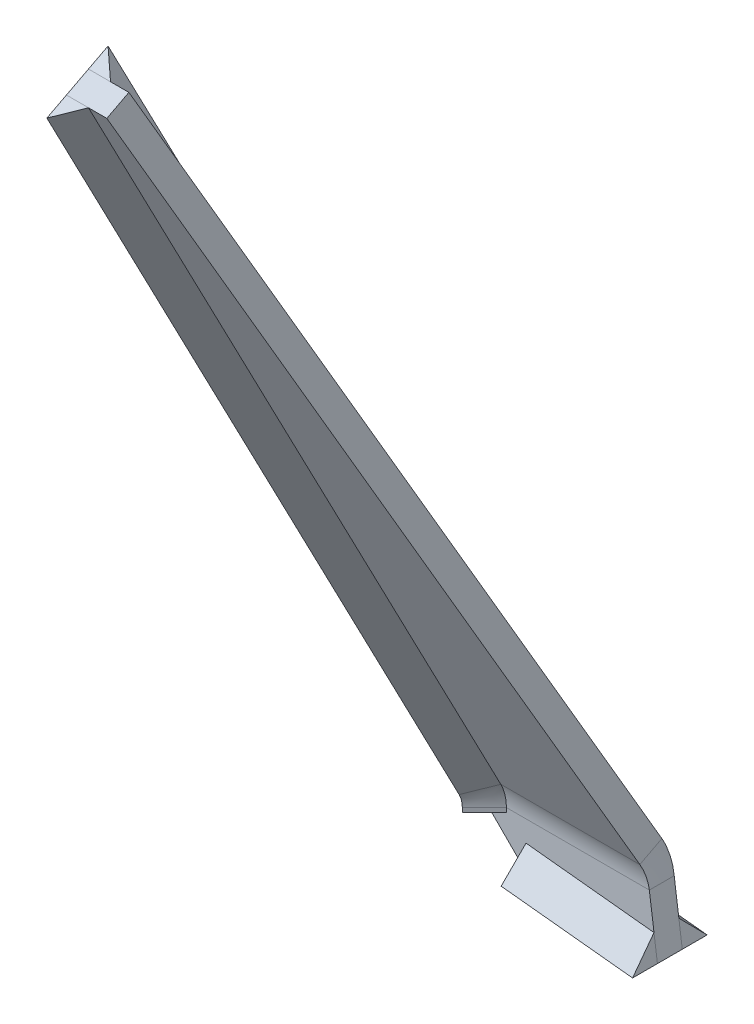
ISO-10303-21;
HEADER;
FILE_DESCRIPTION(('STEP AP214'),'2;1');
FILE_NAME('part.step','',(''),(''),'','','');
FILE_SCHEMA(('AUTOMOTIVE_DESIGN { 1 0 10303 214 1 1 1 1 }'));
ENDSEC;
DATA;
#1=APPLICATION_CONTEXT('core data for automotive mechanical design processes');
#2=APPLICATION_PROTOCOL_DEFINITION('international standard','automotive_design',2000,#1);
#3=PRODUCT_CONTEXT('',#1,'mechanical');
#4=PRODUCT('Part','Part','',(#3));
#5=PRODUCT_RELATED_PRODUCT_CATEGORY('part','',(#4));
#6=PRODUCT_DEFINITION_FORMATION('','',#4);
#7=PRODUCT_DEFINITION_CONTEXT('part definition',#1,'design');
#8=PRODUCT_DEFINITION('design','',#6,#7);
#9=PRODUCT_DEFINITION_SHAPE('','',#8);
#10=(LENGTH_UNIT() NAMED_UNIT(*) SI_UNIT(.MILLI.,.METRE.));
#11=(NAMED_UNIT(*) PLANE_ANGLE_UNIT() SI_UNIT($,.RADIAN.));
#12=(NAMED_UNIT(*) SI_UNIT($,.STERADIAN.) SOLID_ANGLE_UNIT());
#13=UNCERTAINTY_MEASURE_WITH_UNIT(LENGTH_MEASURE(1.E-05),#10,'distance_accuracy_value','');
#14=(GEOMETRIC_REPRESENTATION_CONTEXT(3) GLOBAL_UNCERTAINTY_ASSIGNED_CONTEXT((#13)) GLOBAL_UNIT_ASSIGNED_CONTEXT((#10,
#11,#12)) REPRESENTATION_CONTEXT('',''));
#15=CARTESIAN_POINT('',(0.,0.,0.));
#16=DIRECTION('',(0.,0.,1.));
#17=DIRECTION('',(1.,0.,0.));
#18=AXIS2_PLACEMENT_3D('',#15,#16,#17);
#19=CARTESIAN_POINT('',(3.54804333271289,6.67696676559559,3.99999999585428));
#20=DIRECTION('',(0.,6.51403475213452E-09,1.));
#21=DIRECTION('',(0.,-1.,6.51403475213452E-09));
#22=AXIS2_PLACEMENT_3D('',#19,#20,#21);
#23=PLANE('',#22);
#24=DIRECTION('',(-1.,0.,0.));
#25=VECTOR('',#24,1.);
#26=CARTESIAN_POINT('',(3.54804333271289,6.67696676559559,3.99999999585428));
#27=LINE('',#26,#25);
#28=CARTESIAN_POINT('',(3.54804333271289,6.67696676559559,3.99999999585428));
#29=VERTEX_POINT('',#28);
#30=CARTESIAN_POINT('',(0.,6.67696676559559,3.99999999585428));
#31=VERTEX_POINT('',#30);
#32=EDGE_CURVE('E128',#29,#31,#27,.T.);
#33=ORIENTED_EDGE('',*,*,#32,.F.);
#34=DIRECTION('',(0.,-1.,6.51403475213452E-09));
#35=VECTOR('',#34,1.);
#36=CARTESIAN_POINT('',(3.54804333271289,6.67696676559559,3.99999999585428));
#37=LINE('',#36,#35);
#38=CARTESIAN_POINT('',(3.54804333271289,6.00000000000006,4.00000000026407));
#39=VERTEX_POINT('',#38);
#40=EDGE_CURVE('E71',#29,#39,#37,.T.);
#41=ORIENTED_EDGE('',*,*,#40,.T.);
#42=DIRECTION('',(-1.,0.,0.));
#43=VECTOR('',#42,1.);
#44=CARTESIAN_POINT('',(3.54804333271289,6.00000000000006,4.00000000026407));
#45=LINE('',#44,#43);
#46=CARTESIAN_POINT('',(0.,6.00000000000006,4.00000000026407));
#47=VERTEX_POINT('',#46);
#48=EDGE_CURVE('E78',#39,#47,#45,.T.);
#49=ORIENTED_EDGE('',*,*,#48,.T.);
#50=DIRECTION('',(0.,-1.,6.51403475213452E-09));
#51=VECTOR('',#50,1.);
#52=CARTESIAN_POINT('',(0.,6.67696676559559,3.99999999585428));
#53=LINE('',#52,#51);
#54=EDGE_CURVE('E13',#31,#47,#53,.T.);
#55=ORIENTED_EDGE('',*,*,#54,.F.);
#56=EDGE_LOOP('',(#33,#41,#49,#55));
#57=FACE_BOUND('',#56,.T.);
#58=ADVANCED_FACE('F64',(#57),#23,.F.);
#59=CARTESIAN_POINT('',(0.,6.67696676463847,7.54804332856717));
#60=DIRECTION('',(-0.707106781186548,-4.60611813374007E-09,-0.707106781186547));
#61=DIRECTION('',(-0.707106781186547,0.,0.707106781186548));
#62=AXIS2_PLACEMENT_3D('',#59,#60,#61);
#63=PLANE('',#62);
#64=DIRECTION('',(0.707106781186547,1.90749860351502E-10,-0.707106781186548));
#65=VECTOR('',#64,1.);
#66=CARTESIAN_POINT('',(0.,6.67696676463847,7.54804332856717));
#67=LINE('',#66,#65);
#68=CARTESIAN_POINT('',(0.,6.67696676463847,7.54804332856717));
#69=VERTEX_POINT('',#68);
#70=EDGE_CURVE('E151',#69,#29,#67,.T.);
#71=ORIENTED_EDGE('',*,*,#70,.F.);
#72=DIRECTION('',(0.,-1.,6.51403475213452E-09));
#73=VECTOR('',#72,1.);
#74=CARTESIAN_POINT('',(0.,6.67696676463847,7.54804332856717));
#75=LINE('',#74,#73);
#76=CARTESIAN_POINT('',(0.,5.99999999904293,7.54804333297696));
#77=VERTEX_POINT('',#76);
#78=EDGE_CURVE('E123',#69,#77,#75,.T.);
#79=ORIENTED_EDGE('',*,*,#78,.T.);
#80=DIRECTION('',(0.707106781186547,1.90749860351502E-10,-0.707106781186548));
#81=VECTOR('',#80,1.);
#82=CARTESIAN_POINT('',(0.,5.99999999904293,7.54804333297696));
#83=LINE('',#82,#81);
#84=EDGE_CURVE('E86',#77,#39,#83,.T.);
#85=ORIENTED_EDGE('',*,*,#84,.T.);
#86=ORIENTED_EDGE('',*,*,#40,.F.);
#87=EDGE_LOOP('',(#71,#79,#85,#86));
#88=FACE_BOUND('',#87,.T.);
#89=ADVANCED_FACE('F164',(#88),#63,.F.);
#90=CARTESIAN_POINT('',(0.,6.67696676559554,12.0000000046738));
#91=DIRECTION('',(-1.,0.,0.));
#92=DIRECTION('',(0.,-1.,0.));
#93=AXIS2_PLACEMENT_3D('',#90,#91,#92);
#94=CYLINDRICAL_SURFACE('',#93,8.00000000881955);
#95=DIRECTION('',(-1.,0.,0.));
#96=VECTOR('',#95,1.);
#97=CARTESIAN_POINT('',(3.54804333271289,10.370955673634,4.90391333042855));
#98=LINE('',#97,#96);
#99=CARTESIAN_POINT('',(3.54804333271289,10.370955673634,4.90391333042855));
#100=VERTEX_POINT('',#99);
#101=CARTESIAN_POINT('',(0.,10.370955673634,4.90391333042855));
#102=VERTEX_POINT('',#101);
#103=EDGE_CURVE('E136',#100,#102,#98,.T.);
#104=ORIENTED_EDGE('',*,*,#103,.F.);
#105=CARTESIAN_POINT('',(3.54804333271289,6.67696676559554,12.0000000046738));
#106=DIRECTION('',(-1.,0.,0.));
#107=DIRECTION('',(0.,-1.,0.));
#108=AXIS2_PLACEMENT_3D('',#105,#106,#107);
#109=CIRCLE('',#108,8.00000000881955);
#110=EDGE_CURVE('E127',#100,#29,#109,.T.);
#111=ORIENTED_EDGE('',*,*,#110,.T.);
#112=ORIENTED_EDGE('',*,*,#32,.T.);
#113=CARTESIAN_POINT('',(0.,6.67696676559554,12.0000000046738));
#114=DIRECTION('',(-1.,0.,0.));
#115=DIRECTION('',(0.,-1.,0.));
#116=AXIS2_PLACEMENT_3D('',#113,#114,#115);
#117=CIRCLE('',#116,8.00000000881955);
#118=EDGE_CURVE('E156',#102,#31,#117,.T.);
#119=ORIENTED_EDGE('',*,*,#118,.F.);
#120=EDGE_LOOP('',(#104,#111,#112,#119));
#121=FACE_BOUND('',#120,.T.);
#122=ADVANCED_FACE('F166',(#121),#94,.T.);
#123=CARTESIAN_POINT('',(0.,6.67696676559554,12.0000000046738));
#124=DIRECTION('',(1.,0.,0.));
#125=DIRECTION('',(0.,1.,0.));
#126=AXIS2_PLACEMENT_3D('',#123,#124,#125);
#127=CONICAL_SURFACE('',#126,4.45195667610666,0.785398163397449);
#128=DIRECTION('',(0.707106781186547,0.326505575621977,-0.62721137512625));
#129=VECTOR('',#128,1.);
#130=CARTESIAN_POINT('',(0.,8.73265158505604,8.05106620313065));
#131=LINE('',#130,#129);
#132=CARTESIAN_POINT('',(0.,8.73265158505604,8.05106620313065));
#133=VERTEX_POINT('',#132);
#134=EDGE_CURVE('E131',#133,#100,#131,.T.);
#135=ORIENTED_EDGE('',*,*,#134,.F.);
#136=CARTESIAN_POINT('',(0.,6.67696676559554,12.0000000046738));
#137=DIRECTION('',(-1.,0.,0.));
#138=DIRECTION('',(0.,-1.,0.));
#139=AXIS2_PLACEMENT_3D('',#136,#137,#138);
#140=CIRCLE('',#139,4.45195667610666);
#141=EDGE_CURVE('E116',#133,#69,#140,.T.);
#142=ORIENTED_EDGE('',*,*,#141,.T.);
#143=ORIENTED_EDGE('',*,*,#70,.T.);
#144=ORIENTED_EDGE('',*,*,#110,.F.);
#145=EDGE_LOOP('',(#135,#142,#143,#144));
#146=FACE_BOUND('',#145,.T.);
#147=ADVANCED_FACE('F132',(#146),#127,.F.);
#148=CARTESIAN_POINT('',(0.,10.370955673634,4.90391333042855));
#149=DIRECTION('',(-1.,0.,0.));
#150=DIRECTION('',(0.,-1.,0.));
#151=AXIS2_PLACEMENT_3D('',#148,#149,#150);
#152=PLANE('',#151);
#153=DIRECTION('',(0.,-0.461748613235034,0.887010833178221));
#154=VECTOR('',#153,1.);
#155=CARTESIAN_POINT('',(0.,137.813981670746,71.2465534924042));
#156=LINE('',#155,#154);
#157=CARTESIAN_POINT('',(0.,137.813981670746,71.2465534924042));
#158=VERTEX_POINT('',#157);
#159=CARTESIAN_POINT('',(0.,136.175677582168,74.3937063651063));
#160=VERTEX_POINT('',#159);
#161=EDGE_CURVE('E175',#158,#160,#156,.T.);
#162=ORIENTED_EDGE('',*,*,#161,.F.);
#163=DIRECTION('',(0.,0.887010833163201,0.461748613263889));
#164=VECTOR('',#163,1.);
#165=CARTESIAN_POINT('',(0.,10.370955673634,4.90391333042855));
#166=LINE('',#165,#164);
#167=EDGE_CURVE('E145',#102,#158,#166,.T.);
#168=ORIENTED_EDGE('',*,*,#167,.F.);
#169=ORIENTED_EDGE('',*,*,#118,.T.);
#170=ORIENTED_EDGE('',*,*,#54,.T.);
#171=DIRECTION('',(0.,-2.69761157856152E-10,1.));
#172=VECTOR('',#171,1.);
#173=CARTESIAN_POINT('',(0.,6.00000000000006,4.00000000026407));
#174=LINE('',#173,#172);
#175=EDGE_CURVE('E159',#47,#77,#174,.T.);
#176=ORIENTED_EDGE('',*,*,#175,.T.);
#177=ORIENTED_EDGE('',*,*,#78,.F.);
#178=ORIENTED_EDGE('',*,*,#141,.F.);
#179=DIRECTION('',(0.,0.887010833163201,0.461748613263889));
#180=VECTOR('',#179,1.);
#181=CARTESIAN_POINT('',(0.,8.73265158505604,8.05106620313065));
#182=LINE('',#181,#180);
#183=EDGE_CURVE('E121',#133,#160,#182,.T.);
#184=ORIENTED_EDGE('',*,*,#183,.T.);
#185=EDGE_LOOP('',(#162,#168,#169,#170,#176,#177,#178,#184));
#186=FACE_BOUND('',#185,.T.);
#187=ADVANCED_FACE('F119',(#186),#152,.T.);
#188=CARTESIAN_POINT('',(3.54804333271289,10.370955673634,4.90391333042855));
#189=DIRECTION('',(0.,0.461748613263889,-0.887010833163201));
#190=DIRECTION('',(0.,0.887010833163201,0.461748613263889));
#191=AXIS2_PLACEMENT_3D('',#188,#189,#190);
#192=PLANE('',#191);
#193=DIRECTION('',(-1.,0.,0.));
#194=VECTOR('',#193,1.);
#195=CARTESIAN_POINT('',(3.54804333271288,137.813981670746,71.2465534924042));
#196=LINE('',#195,#194);
#197=CARTESIAN_POINT('',(3.54804333271288,137.813981670746,71.2465534924042));
#198=VERTEX_POINT('',#197);
#199=EDGE_CURVE('E137',#198,#158,#196,.T.);
#200=ORIENTED_EDGE('',*,*,#199,.F.);
#201=DIRECTION('',(0.,0.887010833163201,0.461748613263889));
#202=VECTOR('',#201,1.);
#203=CARTESIAN_POINT('',(3.54804333271289,10.370955673634,4.90391333042855));
#204=LINE('',#203,#202);
#205=EDGE_CURVE('E143',#100,#198,#204,.T.);
#206=ORIENTED_EDGE('',*,*,#205,.F.);
#207=ORIENTED_EDGE('',*,*,#103,.T.);
#208=ORIENTED_EDGE('',*,*,#167,.T.);
#209=EDGE_LOOP('',(#200,#206,#207,#208));
#210=FACE_BOUND('',#209,.T.);
#211=ADVANCED_FACE('F171',(#210),#192,.T.);
#212=CARTESIAN_POINT('',(0.,8.73265158505604,8.05106620313065));
#213=DIRECTION('',(0.707106781186548,-0.326505575642381,0.627211375115628));
#214=DIRECTION('',(0.663578618394135,0.,-0.748106554716727));
#215=AXIS2_PLACEMENT_3D('',#212,#213,#214);
#216=PLANE('',#215);
#217=DIRECTION('',(0.707106781186547,0.326505575621977,-0.62721137512625));
#218=VECTOR('',#217,1.);
#219=CARTESIAN_POINT('',(0.,136.175677582168,74.3937063651063));
#220=LINE('',#219,#218);
#221=EDGE_CURVE('E141',#160,#198,#220,.T.);
#222=ORIENTED_EDGE('',*,*,#221,.F.);
#223=ORIENTED_EDGE('',*,*,#183,.F.);
#224=ORIENTED_EDGE('',*,*,#134,.T.);
#225=ORIENTED_EDGE('',*,*,#205,.T.);
#226=EDGE_LOOP('',(#222,#223,#224,#225));
#227=FACE_BOUND('',#226,.T.);
#228=ADVANCED_FACE('F139',(#227),#216,.T.);
#229=CARTESIAN_POINT('',(0.,6.00000000000006,4.00000000026407));
#230=DIRECTION('',(0.,-1.,-2.69761157856152E-10));
#231=DIRECTION('',(0.,2.69761157856152E-10,-1.));
#232=AXIS2_PLACEMENT_3D('',#229,#230,#231);
#233=PLANE('',#232);
#234=ORIENTED_EDGE('',*,*,#175,.F.);
#235=ORIENTED_EDGE('',*,*,#48,.F.);
#236=ORIENTED_EDGE('',*,*,#84,.F.);
#237=EDGE_LOOP('',(#234,#235,#236));
#238=FACE_BOUND('',#237,.T.);
#239=ADVANCED_FACE('F180',(#238),#233,.T.);
#240=CARTESIAN_POINT('',(0.,137.813981670746,71.2465534924042));
#241=DIRECTION('',(0.,-0.887010833178221,-0.461748613235034));
#242=DIRECTION('',(0.,0.461748613235034,-0.887010833178221));
#243=AXIS2_PLACEMENT_3D('',#240,#241,#242);
#244=PLANE('',#243);
#245=ORIENTED_EDGE('',*,*,#161,.T.);
#246=ORIENTED_EDGE('',*,*,#221,.T.);
#247=ORIENTED_EDGE('',*,*,#199,.T.);
#248=EDGE_LOOP('',(#245,#246,#247));
#249=FACE_BOUND('',#248,.T.);
#250=ADVANCED_FACE('F174',(#249),#244,.F.);
#251=CLOSED_SHELL('',(#58,#89,#122,#147,#187,#211,#228,#239,#250));
#252=MANIFOLD_SOLID_BREP('B2',#251);
#253=CARTESIAN_POINT('',(3.54804333271289,6.67696676667466,-4.14576012408574E-09));
#254=DIRECTION('',(0.,-6.51403475213451E-09,-1.));
#255=DIRECTION('',(0.,1.,-6.51403475213451E-09));
#256=AXIS2_PLACEMENT_3D('',#253,#254,#255);
#257=PLANE('',#256);
#258=DIRECTION('',(1.,0.,0.));
#259=VECTOR('',#258,1.);
#260=CARTESIAN_POINT('',(3.54804333271289,6.67696676667466,-4.14576012408574E-09));
#261=LINE('',#260,#259);
#262=CARTESIAN_POINT('',(0.,6.67696676667466,-4.14575838936226E-09));
#263=VERTEX_POINT('',#262);
#264=CARTESIAN_POINT('',(3.54804333271289,6.67696676667466,-4.14576012408574E-09));
#265=VERTEX_POINT('',#264);
#266=EDGE_CURVE('E334',#263,#265,#261,.T.);
#267=ORIENTED_EDGE('',*,*,#266,.F.);
#268=DIRECTION('',(0.,-1.,6.51403475213452E-09));
#269=VECTOR('',#268,1.);
#270=CARTESIAN_POINT('',(0.,6.67696676667466,-4.14575838936226E-09));
#271=LINE('',#270,#269);
#272=CARTESIAN_POINT('',(0.,6.00000000107912,2.64026647767146E-10));
#273=VERTEX_POINT('',#272);
#274=EDGE_CURVE('E277',#263,#273,#271,.T.);
#275=ORIENTED_EDGE('',*,*,#274,.T.);
#276=DIRECTION('',(1.,0.,0.));
#277=VECTOR('',#276,1.);
#278=CARTESIAN_POINT('',(3.54804333271289,6.00000000107912,2.6402491304367E-10));
#279=LINE('',#278,#277);
#280=CARTESIAN_POINT('',(3.54804333271289,6.00000000107912,2.6402491304367E-10));
#281=VERTEX_POINT('',#280);
#282=EDGE_CURVE('E284',#273,#281,#279,.T.);
#283=ORIENTED_EDGE('',*,*,#282,.T.);
#284=DIRECTION('',(0.,-1.,6.51403475213452E-09));
#285=VECTOR('',#284,1.);
#286=CARTESIAN_POINT('',(3.54804333271289,6.67696676667466,-4.14576012408574E-09));
#287=LINE('',#286,#285);
#288=EDGE_CURVE('E62',#265,#281,#287,.T.);
#289=ORIENTED_EDGE('',*,*,#288,.F.);
#290=EDGE_LOOP('',(#267,#275,#283,#289));
#291=FACE_BOUND('',#290,.T.);
#292=ADVANCED_FACE('F270',(#291),#257,.F.);
#293=CARTESIAN_POINT('',(0.,6.67696676763178,-3.54804333685865));
#294=DIRECTION('',(-0.707106781186548,4.60611815849822E-09,0.707106781186547));
#295=DIRECTION('',(0.707106781186547,0.,0.707106781186548));
#296=AXIS2_PLACEMENT_3D('',#293,#294,#295);
#297=PLANE('',#296);
#298=DIRECTION('',(-0.707106781186547,1.90749971373805E-10,-0.707106781186548));
#299=VECTOR('',#298,1.);
#300=CARTESIAN_POINT('',(0.,6.67696676763178,-3.54804333685865));
#301=LINE('',#300,#299);
#302=CARTESIAN_POINT('',(0.,6.67696676763178,-3.54804333685865));
#303=VERTEX_POINT('',#302);
#304=EDGE_CURVE('E332',#265,#303,#301,.T.);
#305=ORIENTED_EDGE('',*,*,#304,.F.);
#306=ORIENTED_EDGE('',*,*,#288,.T.);
#307=DIRECTION('',(-0.707106781186547,1.90749971373805E-10,-0.707106781186548));
#308=VECTOR('',#307,1.);
#309=CARTESIAN_POINT('',(0.,6.00000000203625,-3.54804333244886));
#310=LINE('',#309,#308);
#311=CARTESIAN_POINT('',(0.,6.00000000203625,-3.54804333244886));
#312=VERTEX_POINT('',#311);
#313=EDGE_CURVE('E368',#281,#312,#310,.T.);
#314=ORIENTED_EDGE('',*,*,#313,.T.);
#315=DIRECTION('',(0.,-1.,6.51403475213452E-09));
#316=VECTOR('',#315,1.);
#317=CARTESIAN_POINT('',(0.,6.67696676763178,-3.54804333685865));
#318=LINE('',#317,#316);
#319=EDGE_CURVE('E372',#303,#312,#318,.T.);
#320=ORIENTED_EDGE('',*,*,#319,.F.);
#321=EDGE_LOOP('',(#305,#306,#314,#320));
#322=FACE_BOUND('',#321,.T.);
#323=ADVANCED_FACE('F393',(#322),#297,.F.);
#324=CARTESIAN_POINT('',(0.,6.67696676559554,12.0000000046738));
#325=DIRECTION('',(-1.,0.,0.));
#326=DIRECTION('',(0.,-1.,0.));
#327=AXIS2_PLACEMENT_3D('',#324,#325,#326);
#328=CYLINDRICAL_SURFACE('',#327,12.0000000088196);
#329=DIRECTION('',(1.,0.,0.));
#330=VECTOR('',#329,1.);
#331=CARTESIAN_POINT('',(3.54804333271289,12.2179501265742,1.35586999771564));
#332=LINE('',#331,#330);
#333=CARTESIAN_POINT('',(0.,12.2179501265742,1.35586999771564));
#334=VERTEX_POINT('',#333);
#335=CARTESIAN_POINT('',(3.54804333271289,12.2179501265742,1.35586999771564));
#336=VERTEX_POINT('',#335);
#337=EDGE_CURVE('E345',#334,#336,#332,.T.);
#338=ORIENTED_EDGE('',*,*,#337,.F.);
#339=CARTESIAN_POINT('',(0.,6.67696676559554,12.0000000046738));
#340=DIRECTION('',(-1.,0.,0.));
#341=DIRECTION('',(0.,-1.,0.));
#342=AXIS2_PLACEMENT_3D('',#339,#340,#341);
#343=CIRCLE('',#342,12.0000000088196);
#344=EDGE_CURVE('E333',#334,#263,#343,.T.);
#345=ORIENTED_EDGE('',*,*,#344,.T.);
#346=ORIENTED_EDGE('',*,*,#266,.T.);
#347=CARTESIAN_POINT('',(3.54804333271289,6.67696676559554,12.0000000046738));
#348=DIRECTION('',(-1.,0.,0.));
#349=DIRECTION('',(0.,-1.,0.));
#350=AXIS2_PLACEMENT_3D('',#347,#348,#349);
#351=CIRCLE('',#350,12.0000000088196);
#352=EDGE_CURVE('E366',#336,#265,#351,.T.);
#353=ORIENTED_EDGE('',*,*,#352,.F.);
#354=EDGE_LOOP('',(#338,#345,#346,#353));
#355=FACE_BOUND('',#354,.T.);
#356=ADVANCED_FACE('F377',(#355),#328,.F.);
#357=CARTESIAN_POINT('',(3.54804333271289,6.67696676559554,12.0000000046738));
#358=DIRECTION('',(-1.,0.,0.));
#359=DIRECTION('',(0.,-1.,0.));
#360=AXIS2_PLACEMENT_3D('',#357,#358,#359);
#361=CONICAL_SURFACE('',#360,12.0000000088196,0.785398163397448);
#362=DIRECTION('',(-0.707106781186547,0.326505575621977,-0.62721137512625));
#363=VECTOR('',#362,1.);
#364=CARTESIAN_POINT('',(0.,13.8562542151522,-1.79128287498645));
#365=LINE('',#364,#363);
#366=CARTESIAN_POINT('',(0.,13.8562542151522,-1.79128287498645));
#367=VERTEX_POINT('',#366);
#368=EDGE_CURVE('E329',#336,#367,#365,.T.);
#369=ORIENTED_EDGE('',*,*,#368,.F.);
#370=ORIENTED_EDGE('',*,*,#352,.T.);
#371=ORIENTED_EDGE('',*,*,#304,.T.);
#372=CARTESIAN_POINT('',(0.,6.67696676559554,12.0000000046738));
#373=DIRECTION('',(-1.,0.,0.));
#374=DIRECTION('',(0.,-1.,0.));
#375=AXIS2_PLACEMENT_3D('',#372,#373,#374);
#376=CIRCLE('',#375,15.5480433415325);
#377=EDGE_CURVE('E324',#367,#303,#376,.T.);
#378=ORIENTED_EDGE('',*,*,#377,.F.);
#379=EDGE_LOOP('',(#369,#370,#371,#378));
#380=FACE_BOUND('',#379,.T.);
#381=ADVANCED_FACE('F326',(#380),#361,.T.);
#382=CARTESIAN_POINT('',(0.,13.8562542151522,-1.79128287498645));
#383=DIRECTION('',(0.707106781186548,0.326505575642381,-0.627211375115628));
#384=DIRECTION('',(-0.663578618394135,0.,-0.748106554716727));
#385=AXIS2_PLACEMENT_3D('',#382,#383,#384);
#386=PLANE('',#385);
#387=DIRECTION('',(-0.707106781186547,0.326505575621977,-0.62721137512625));
#388=VECTOR('',#387,1.);
#389=CARTESIAN_POINT('',(0.,141.299280212265,64.5513572869892));
#390=LINE('',#389,#388);
#391=CARTESIAN_POINT('',(3.54804333271288,139.660976123687,67.6985101596913));
#392=VERTEX_POINT('',#391);
#393=CARTESIAN_POINT('',(0.,141.299280212265,64.5513572869892));
#394=VERTEX_POINT('',#393);
#395=EDGE_CURVE('E356',#392,#394,#390,.T.);
#396=ORIENTED_EDGE('',*,*,#395,.F.);
#397=DIRECTION('',(0.,0.887010833163201,0.461748613263889));
#398=VECTOR('',#397,1.);
#399=CARTESIAN_POINT('',(3.54804333271289,12.2179501265742,1.35586999771564));
#400=LINE('',#399,#398);
#401=EDGE_CURVE('E348',#336,#392,#400,.T.);
#402=ORIENTED_EDGE('',*,*,#401,.F.);
#403=ORIENTED_EDGE('',*,*,#368,.T.);
#404=DIRECTION('',(0.,0.887010833163201,0.461748613263889));
#405=VECTOR('',#404,1.);
#406=CARTESIAN_POINT('',(0.,13.8562542151522,-1.79128287498645));
#407=LINE('',#406,#405);
#408=EDGE_CURVE('E337',#367,#394,#407,.T.);
#409=ORIENTED_EDGE('',*,*,#408,.T.);
#410=EDGE_LOOP('',(#396,#402,#403,#409));
#411=FACE_BOUND('',#410,.T.);
#412=ADVANCED_FACE('F347',(#411),#386,.T.);
#413=CARTESIAN_POINT('',(3.54804333271289,12.2179501265742,1.35586999771564));
#414=DIRECTION('',(0.,-0.461748613263889,0.887010833163201));
#415=DIRECTION('',(0.,-0.887010833163201,-0.461748613263889));
#416=AXIS2_PLACEMENT_3D('',#413,#414,#415);
#417=PLANE('',#416);
#418=DIRECTION('',(1.,0.,0.));
#419=VECTOR('',#418,1.);
#420=CARTESIAN_POINT('',(3.54804333271288,139.660976123687,67.6985101596913));
#421=LINE('',#420,#419);
#422=CARTESIAN_POINT('',(0.,139.660976123687,67.6985101596913));
#423=VERTEX_POINT('',#422);
#424=EDGE_CURVE('E350',#423,#392,#421,.T.);
#425=ORIENTED_EDGE('',*,*,#424,.F.);
#426=DIRECTION('',(0.,0.887010833163201,0.461748613263889));
#427=VECTOR('',#426,1.);
#428=CARTESIAN_POINT('',(0.,12.2179501265742,1.35586999771564));
#429=LINE('',#428,#427);
#430=EDGE_CURVE('E344',#334,#423,#429,.T.);
#431=ORIENTED_EDGE('',*,*,#430,.F.);
#432=ORIENTED_EDGE('',*,*,#337,.T.);
#433=ORIENTED_EDGE('',*,*,#401,.T.);
#434=EDGE_LOOP('',(#425,#431,#432,#433));
#435=FACE_BOUND('',#434,.T.);
#436=ADVANCED_FACE('F380',(#435),#417,.T.);
#437=CARTESIAN_POINT('',(0.,12.2179501265742,1.35586999771564));
#438=DIRECTION('',(-1.,0.,0.));
#439=DIRECTION('',(0.,-1.,0.));
#440=AXIS2_PLACEMENT_3D('',#437,#438,#439);
#441=PLANE('',#440);
#442=DIRECTION('',(0.,-0.461748613235034,0.887010833178221));
#443=VECTOR('',#442,1.);
#444=CARTESIAN_POINT('',(0.,139.660976123687,67.6985101596913));
#445=LINE('',#444,#443);
#446=EDGE_CURVE('E340',#394,#423,#445,.T.);
#447=ORIENTED_EDGE('',*,*,#446,.F.);
#448=ORIENTED_EDGE('',*,*,#408,.F.);
#449=ORIENTED_EDGE('',*,*,#377,.T.);
#450=ORIENTED_EDGE('',*,*,#319,.T.);
#451=DIRECTION('',(0.,-2.69761157856152E-10,1.));
#452=VECTOR('',#451,1.);
#453=CARTESIAN_POINT('',(0.,6.00000000107912,2.64026647767146E-10));
#454=LINE('',#453,#452);
#455=EDGE_CURVE('E292',#312,#273,#454,.T.);
#456=ORIENTED_EDGE('',*,*,#455,.T.);
#457=ORIENTED_EDGE('',*,*,#274,.F.);
#458=ORIENTED_EDGE('',*,*,#344,.F.);
#459=ORIENTED_EDGE('',*,*,#430,.T.);
#460=EDGE_LOOP('',(#447,#448,#449,#450,#456,#457,#458,#459));
#461=FACE_BOUND('',#460,.T.);
#462=ADVANCED_FACE('F338',(#461),#441,.T.);
#463=CARTESIAN_POINT('',(3.54804333271289,6.00000000107912,2.6402491304367E-10));
#464=DIRECTION('',(0.,-1.,-2.69761102345001E-10));
#465=DIRECTION('',(0.,2.69761102345001E-10,-1.));
#466=AXIS2_PLACEMENT_3D('',#463,#464,#465);
#467=PLANE('',#466);
#468=ORIENTED_EDGE('',*,*,#313,.F.);
#469=ORIENTED_EDGE('',*,*,#282,.F.);
#470=ORIENTED_EDGE('',*,*,#455,.F.);
#471=EDGE_LOOP('',(#468,#469,#470));
#472=FACE_BOUND('',#471,.T.);
#473=ADVANCED_FACE('F384',(#472),#467,.T.);
#474=CARTESIAN_POINT('',(3.54804333271288,139.660976123687,67.6985101596913));
#475=DIRECTION('',(0.,-0.887010833178221,-0.461748613235034));
#476=DIRECTION('',(0.,0.461748613235034,-0.887010833178221));
#477=AXIS2_PLACEMENT_3D('',#474,#475,#476);
#478=PLANE('',#477);
#479=ORIENTED_EDGE('',*,*,#395,.T.);
#480=ORIENTED_EDGE('',*,*,#446,.T.);
#481=ORIENTED_EDGE('',*,*,#424,.T.);
#482=EDGE_LOOP('',(#479,#480,#481));
#483=FACE_BOUND('',#482,.T.);
#484=ADVANCED_FACE('F382',(#483),#478,.F.);
#485=CLOSED_SHELL('',(#292,#323,#356,#381,#412,#436,#462,#473,#484));
#486=MANIFOLD_SOLID_BREP('B7',#485);
#487=CARTESIAN_POINT('',(6.70469146960511,-0.704691469605121,4.));
#488=DIRECTION('',(-1.,0.,0.));
#489=DIRECTION('',(0.,0.,1.));
#490=AXIS2_PLACEMENT_3D('',#487,#488,#489);
#491=PLANE('',#490);
#492=DIRECTION('',(0.,1.,0.));
#493=VECTOR('',#492,1.);
#494=CARTESIAN_POINT('',(6.70469146960511,3.29530853039488,4.));
#495=LINE('',#494,#493);
#496=CARTESIAN_POINT('',(6.70469146960511,-0.704691469605121,4.));
#497=VERTEX_POINT('',#496);
#498=CARTESIAN_POINT('',(6.70469146960511,3.29530853039488,4.));
#499=VERTEX_POINT('',#498);
#500=EDGE_CURVE('E518',#497,#499,#495,.T.);
#501=ORIENTED_EDGE('',*,*,#500,.F.);
#502=DIRECTION('',(0.,0.,-1.));
#503=VECTOR('',#502,1.);
#504=CARTESIAN_POINT('',(6.70469146960511,-0.704691469605121,4.));
#505=LINE('',#504,#503);
#506=CARTESIAN_POINT('',(6.70469146960511,-0.704691469605122,8.));
#507=VERTEX_POINT('',#506);
#508=EDGE_CURVE('E520',#507,#497,#505,.T.);
#509=ORIENTED_EDGE('',*,*,#508,.F.);
#510=DIRECTION('',(0.,-0.707106781186548,0.707106781186547));
#511=VECTOR('',#510,1.);
#512=CARTESIAN_POINT('',(6.70469146960511,3.29530853039488,4.));
#513=LINE('',#512,#511);
#514=EDGE_CURVE('E511',#499,#507,#513,.T.);
#515=ORIENTED_EDGE('',*,*,#514,.F.);
#516=EDGE_LOOP('',(#501,#509,#515));
#517=FACE_BOUND('',#516,.T.);
#518=ADVANCED_FACE('F476',(#517),#491,.T.);
#519=CARTESIAN_POINT('',(33.2805950239565,-3.49793148917952,4.));
#520=DIRECTION('',(0.104528463267651,0.994521895368274,0.));
#521=DIRECTION('',(-0.994521895368274,0.104528463267651,0.));
#522=AXIS2_PLACEMENT_3D('',#519,#520,#521);
#523=PLANE('',#522);
#524=DIRECTION('',(-0.994521895368274,0.104528463267651,0.));
#525=VECTOR('',#524,1.);
#526=CARTESIAN_POINT('',(33.2805950239565,-3.49793148917952,4.));
#527=LINE('',#526,#525);
#528=CARTESIAN_POINT('',(27.8466130703117,-2.92679697149421,4.));
#529=VERTEX_POINT('',#528);
#530=EDGE_CURVE('E523',#529,#497,#527,.T.);
#531=ORIENTED_EDGE('',*,*,#530,.F.);
#532=DIRECTION('',(0.,0.,1.));
#533=VECTOR('',#532,1.);
#534=CARTESIAN_POINT('',(27.8466130703117,-2.92679697149421,4.));
#535=LINE('',#534,#533);
#536=CARTESIAN_POINT('',(27.8466130703117,-2.92679697149421,8.));
#537=VERTEX_POINT('',#536);
#538=EDGE_CURVE('E480',#529,#537,#535,.T.);
#539=ORIENTED_EDGE('',*,*,#538,.T.);
#540=DIRECTION('',(-0.994521895368274,0.104528463267651,0.));
#541=VECTOR('',#540,1.);
#542=CARTESIAN_POINT('',(33.2805950239565,-3.49793148917952,8.));
#543=LINE('',#542,#541);
#544=EDGE_CURVE('E515',#537,#507,#543,.T.);
#545=ORIENTED_EDGE('',*,*,#544,.T.);
#546=ORIENTED_EDGE('',*,*,#508,.T.);
#547=EDGE_LOOP('',(#531,#539,#545,#546));
#548=FACE_BOUND('',#547,.T.);
#549=ADVANCED_FACE('F531',(#548),#523,.F.);
#550=CARTESIAN_POINT('',(33.2805950239565,0.502068510820482,4.));
#551=DIRECTION('',(-0.0741155126847491,-0.70516199939428,-0.70516199939428));
#552=DIRECTION('',(0.,0.707106781186548,-0.707106781186547));
#553=AXIS2_PLACEMENT_3D('',#550,#551,#552);
#554=PLANE('',#553);
#555=ORIENTED_EDGE('',*,*,#544,.F.);
#556=DIRECTION('',(-0.0958164778483682,0.708870741875587,-0.698800024245483));
#557=VECTOR('',#556,1.);
#558=CARTESIAN_POINT('',(27.3957814505822,0.408551518817847,4.71203582231319));
#559=LINE('',#558,#557);
#560=CARTESIAN_POINT('',(27.2981501365742,1.13084880572783,4.));
#561=VERTEX_POINT('',#560);
#562=EDGE_CURVE('E486',#537,#561,#559,.T.);
#563=ORIENTED_EDGE('',*,*,#562,.T.);
#564=DIRECTION('',(-0.994521895368274,0.104528463267651,0.));
#565=VECTOR('',#564,1.);
#566=CARTESIAN_POINT('',(33.2805950239565,0.502068510820482,4.));
#567=LINE('',#566,#565);
#568=EDGE_CURVE('E507',#561,#499,#567,.T.);
#569=ORIENTED_EDGE('',*,*,#568,.T.);
#570=ORIENTED_EDGE('',*,*,#514,.T.);
#571=EDGE_LOOP('',(#555,#563,#569,#570));
#572=FACE_BOUND('',#571,.T.);
#573=ADVANCED_FACE('F510',(#572),#554,.F.);
#574=CARTESIAN_POINT('',(33.2805950239565,0.502068510820482,4.));
#575=DIRECTION('',(0.,0.,1.));
#576=DIRECTION('',(0.,-1.,0.));
#577=AXIS2_PLACEMENT_3D('',#574,#575,#576);
#578=PLANE('',#577);
#579=ORIENTED_EDGE('',*,*,#568,.F.);
#580=DIRECTION('',(0.133949657316128,-0.990988137822493,0.));
#581=VECTOR('',#580,1.);
#582=CARTESIAN_POINT('',(27.4889560997429,-0.280774410893807,4.));
#583=LINE('',#582,#581);
#584=EDGE_CURVE('E268',#561,#529,#583,.T.);
#585=ORIENTED_EDGE('',*,*,#584,.T.);
#586=ORIENTED_EDGE('',*,*,#530,.T.);
#587=ORIENTED_EDGE('',*,*,#500,.T.);
#588=EDGE_LOOP('',(#579,#585,#586,#587));
#589=FACE_BOUND('',#588,.T.);
#590=ADVANCED_FACE('F478',(#589),#578,.F.);
#591=CARTESIAN_POINT('',(27.8466130703117,-2.92679697149421,4.));
#592=DIRECTION('',(-0.990988137822493,-0.133949657316128,0.));
#593=DIRECTION('',(0.133949657316128,-0.990988137822493,0.));
#594=AXIS2_PLACEMENT_3D('',#591,#592,#593);
#595=PLANE('',#594);
#596=ORIENTED_EDGE('',*,*,#562,.F.);
#597=ORIENTED_EDGE('',*,*,#538,.F.);
#598=ORIENTED_EDGE('',*,*,#584,.F.);
#599=EDGE_LOOP('',(#596,#597,#598));
#600=FACE_BOUND('',#599,.T.);
#601=ADVANCED_FACE('F532',(#600),#595,.F.);
#602=CLOSED_SHELL('',(#518,#549,#573,#590,#601));
#603=MANIFOLD_SOLID_BREP('B56',#602);
#604=CARTESIAN_POINT('',(6.70469146960511,-0.70469146960512,-4.));
#605=DIRECTION('',(1.,0.,0.));
#606=DIRECTION('',(0.,0.,-1.));
#607=AXIS2_PLACEMENT_3D('',#604,#605,#606);
#608=PLANE('',#607);
#609=DIRECTION('',(0.,0.707106781186547,0.707106781186548));
#610=VECTOR('',#609,1.);
#611=CARTESIAN_POINT('',(6.70469146960511,3.29530853039488,0.));
#612=LINE('',#611,#610);
#613=CARTESIAN_POINT('',(6.70469146960511,-0.70469146960512,-4.));
#614=VERTEX_POINT('',#613);
#615=CARTESIAN_POINT('',(6.70469146960511,3.29530853039488,0.));
#616=VERTEX_POINT('',#615);
#617=EDGE_CURVE('E625',#614,#616,#612,.T.);
#618=ORIENTED_EDGE('',*,*,#617,.F.);
#619=DIRECTION('',(0.,0.,-1.));
#620=VECTOR('',#619,1.);
#621=CARTESIAN_POINT('',(6.70469146960511,-0.70469146960512,0.));
#622=LINE('',#621,#620);
#623=CARTESIAN_POINT('',(6.70469146960511,-0.70469146960512,0.));
#624=VERTEX_POINT('',#623);
#625=EDGE_CURVE('E627',#624,#614,#622,.T.);
#626=ORIENTED_EDGE('',*,*,#625,.F.);
#627=DIRECTION('',(0.,-1.,0.));
#628=VECTOR('',#627,1.);
#629=CARTESIAN_POINT('',(6.70469146960511,3.29530853039488,0.));
#630=LINE('',#629,#628);
#631=EDGE_CURVE('E618',#616,#624,#630,.T.);
#632=ORIENTED_EDGE('',*,*,#631,.F.);
#633=EDGE_LOOP('',(#618,#626,#632));
#634=FACE_BOUND('',#633,.T.);
#635=ADVANCED_FACE('F583',(#634),#608,.F.);
#636=CARTESIAN_POINT('',(33.2805950239565,-3.49793148917952,0.));
#637=DIRECTION('',(0.104528463267651,0.994521895368274,0.));
#638=DIRECTION('',(-0.994521895368274,0.104528463267651,0.));
#639=AXIS2_PLACEMENT_3D('',#636,#637,#638);
#640=PLANE('',#639);
#641=DIRECTION('',(-0.994521895368274,0.104528463267651,0.));
#642=VECTOR('',#641,1.);
#643=CARTESIAN_POINT('',(33.2805950239565,-3.49793148917952,-4.));
#644=LINE('',#643,#642);
#645=CARTESIAN_POINT('',(27.8466130703117,-2.92679697149421,-4.));
#646=VERTEX_POINT('',#645);
#647=EDGE_CURVE('E630',#646,#614,#644,.T.);
#648=ORIENTED_EDGE('',*,*,#647,.F.);
#649=DIRECTION('',(0.,0.,1.));
#650=VECTOR('',#649,1.);
#651=CARTESIAN_POINT('',(27.8466130703117,-2.92679697149421,0.));
#652=LINE('',#651,#650);
#653=CARTESIAN_POINT('',(27.8466130703117,-2.92679697149421,0.));
#654=VERTEX_POINT('',#653);
#655=EDGE_CURVE('E587',#646,#654,#652,.T.);
#656=ORIENTED_EDGE('',*,*,#655,.T.);
#657=DIRECTION('',(-0.994521895368274,0.104528463267651,0.));
#658=VECTOR('',#657,1.);
#659=CARTESIAN_POINT('',(33.2805950239565,-3.49793148917952,0.));
#660=LINE('',#659,#658);
#661=EDGE_CURVE('E622',#654,#624,#660,.T.);
#662=ORIENTED_EDGE('',*,*,#661,.T.);
#663=ORIENTED_EDGE('',*,*,#625,.T.);
#664=EDGE_LOOP('',(#648,#656,#662,#663));
#665=FACE_BOUND('',#664,.T.);
#666=ADVANCED_FACE('F638',(#665),#640,.F.);
#667=CARTESIAN_POINT('',(33.2805950239565,0.502068510820482,0.));
#668=DIRECTION('',(0.,0.,-1.));
#669=DIRECTION('',(0.,1.,0.));
#670=AXIS2_PLACEMENT_3D('',#667,#668,#669);
#671=PLANE('',#670);
#672=ORIENTED_EDGE('',*,*,#661,.F.);
#673=DIRECTION('',(-0.133949657316128,0.990988137822493,0.));
#674=VECTOR('',#673,1.);
#675=CARTESIAN_POINT('',(27.4889560997429,-0.280774410893806,0.));
#676=LINE('',#675,#674);
#677=CARTESIAN_POINT('',(27.2981501365742,1.13084880572784,0.));
#678=VERTEX_POINT('',#677);
#679=EDGE_CURVE('E593',#654,#678,#676,.T.);
#680=ORIENTED_EDGE('',*,*,#679,.T.);
#681=DIRECTION('',(-0.994521895368274,0.104528463267651,0.));
#682=VECTOR('',#681,1.);
#683=CARTESIAN_POINT('',(33.2805950239565,0.502068510820482,0.));
#684=LINE('',#683,#682);
#685=EDGE_CURVE('E614',#678,#616,#684,.T.);
#686=ORIENTED_EDGE('',*,*,#685,.T.);
#687=ORIENTED_EDGE('',*,*,#631,.T.);
#688=EDGE_LOOP('',(#672,#680,#686,#687));
#689=FACE_BOUND('',#688,.T.);
#690=ADVANCED_FACE('F617',(#689),#671,.F.);
#691=CARTESIAN_POINT('',(33.2805950239565,0.502068510820482,0.));
#692=DIRECTION('',(-0.0741155126847491,-0.70516199939428,0.70516199939428));
#693=DIRECTION('',(0.,-0.707106781186548,-0.707106781186548));
#694=AXIS2_PLACEMENT_3D('',#691,#692,#693);
#695=PLANE('',#694);
#696=ORIENTED_EDGE('',*,*,#685,.F.);
#697=DIRECTION('',(0.0958164778483682,-0.708870741875587,-0.698800024245484));
#698=VECTOR('',#697,1.);
#699=CARTESIAN_POINT('',(27.3957814505822,0.408551518817848,-0.712035822313192));
#700=LINE('',#699,#698);
#701=EDGE_CURVE('E474',#678,#646,#700,.T.);
#702=ORIENTED_EDGE('',*,*,#701,.T.);
#703=ORIENTED_EDGE('',*,*,#647,.T.);
#704=ORIENTED_EDGE('',*,*,#617,.T.);
#705=EDGE_LOOP('',(#696,#702,#703,#704));
#706=FACE_BOUND('',#705,.T.);
#707=ADVANCED_FACE('F585',(#706),#695,.F.);
#708=CARTESIAN_POINT('',(27.8466130703117,-2.92679697149421,4.));
#709=DIRECTION('',(-0.990988137822493,-0.133949657316128,0.));
#710=DIRECTION('',(0.133949657316128,-0.990988137822493,0.));
#711=AXIS2_PLACEMENT_3D('',#708,#709,#710);
#712=PLANE('',#711);
#713=ORIENTED_EDGE('',*,*,#679,.F.);
#714=ORIENTED_EDGE('',*,*,#655,.F.);
#715=ORIENTED_EDGE('',*,*,#701,.F.);
#716=EDGE_LOOP('',(#713,#714,#715));
#717=FACE_BOUND('',#716,.T.);
#718=ADVANCED_FACE('F639',(#717),#712,.F.);
#719=CLOSED_SHELL('',(#635,#666,#690,#707,#718));
#720=MANIFOLD_SOLID_BREP('B262',#719);
#721=CARTESIAN_POINT('',(0.,137.813981670746,71.2465534924041));
#722=DIRECTION('',(1.,0.,0.));
#723=DIRECTION('',(0.,0.887010833178221,0.461748613235035));
#724=AXIS2_PLACEMENT_3D('',#721,#722,#723);
#725=PLANE('',#724);
#726=DIRECTION('',(0.,-0.887010833178221,-0.461748613235035));
#727=VECTOR('',#726,1.);
#728=CARTESIAN_POINT('',(0.,139.660976123686,67.6985101596913));
#729=LINE('',#728,#727);
#730=CARTESIAN_POINT('',(0.,139.660976123686,67.6985101596913));
#731=VERTEX_POINT('',#730);
#732=CARTESIAN_POINT('',(0.,12.2179501265742,1.35586999771564));
#733=VERTEX_POINT('',#732);
#734=EDGE_CURVE('E789',#731,#733,#729,.T.);
#735=ORIENTED_EDGE('',*,*,#734,.T.);
#736=DIRECTION('',(0.,-0.461748613235041,0.887010833178218));
#737=VECTOR('',#736,1.);
#738=CARTESIAN_POINT('',(0.,10.3709556714763,4.90391333457333));
#739=LINE('',#738,#737);
#740=CARTESIAN_POINT('',(0.,10.370955673634,4.90391333042851));
#741=VERTEX_POINT('',#740);
#742=EDGE_CURVE('E763',#733,#741,#739,.T.);
#743=ORIENTED_EDGE('',*,*,#742,.T.);
#744=DIRECTION('',(0.,-0.887010833178221,-0.461748613235035));
#745=VECTOR('',#744,1.);
#746=CARTESIAN_POINT('',(0.,137.813981670746,71.2465534924041));
#747=LINE('',#746,#745);
#748=CARTESIAN_POINT('',(0.,137.813981670746,71.2465534924041));
#749=VERTEX_POINT('',#748);
#750=EDGE_CURVE('E777',#749,#741,#747,.T.);
#751=ORIENTED_EDGE('',*,*,#750,.F.);
#752=DIRECTION('',(0.,0.461748613235035,-0.887010833178221));
#753=VECTOR('',#752,1.);
#754=CARTESIAN_POINT('',(0.,137.813981670746,71.2465534924041));
#755=LINE('',#754,#753);
#756=EDGE_CURVE('E872',#749,#731,#755,.T.);
#757=ORIENTED_EDGE('',*,*,#756,.T.);
#758=EDGE_LOOP('',(#735,#743,#751,#757));
#759=FACE_BOUND('',#758,.T.);
#760=ADVANCED_FACE('F682',(#759),#725,.F.);
#761=CARTESIAN_POINT('',(27.8466130703117,-2.26879809210653,-1.67592600183421));
#762=DIRECTION('',(-0.990988137822493,-0.118814797139916,-0.0618510685090306));
#763=DIRECTION('',(0.133949657316128,-0.879017213799663,-0.457587398371906));
#764=AXIS2_PLACEMENT_3D('',#761,#762,#763);
#765=PLANE('',#764);
#766=DIRECTION('',(-0.133949657316128,0.879017213799663,0.457587398371905));
#767=VECTOR('',#766,1.);
#768=CARTESIAN_POINT('',(27.8466130703117,-2.26879809210653,-1.67592600183421));
#769=LINE('',#768,#767);
#770=CARTESIAN_POINT('',(25.9204952894396,10.3709556714758,4.90391333457422));
#771=VERTEX_POINT('',#770);
#772=CARTESIAN_POINT('',(6.49999999999999,137.813981670746,71.2465534924041));
#773=VERTEX_POINT('',#772);
#774=EDGE_CURVE('E784',#771,#773,#769,.T.);
#775=ORIENTED_EDGE('',*,*,#774,.F.);
#776=CARTESIAN_POINT('',(25.9204952894396,12.2179501265741,1.35586999771562));
#777=CARTESIAN_POINT('',(25.9204952894396,10.370955673634,4.9039133304285));
#778=B_SPLINE_CURVE_WITH_KNOTS('',1,(#776,#777),.UNSPECIFIED.,.F.,.F.,(2,2),(0.,1.),.UNSPECIFIED.);
#779=CARTESIAN_POINT('',(25.9204952894396,12.2179501265741,1.35586999771563));
#780=VERTEX_POINT('',#779);
#781=EDGE_CURVE('E793',#771,#780,#778,.F.);
#782=ORIENTED_EDGE('',*,*,#781,.T.);
#783=DIRECTION('',(-0.133949657316128,0.879017213799663,0.457587398371905));
#784=VECTOR('',#783,1.);
#785=CARTESIAN_POINT('',(27.8466130703117,-0.421803639166393,-5.22396933454709));
#786=LINE('',#785,#784);
#787=CARTESIAN_POINT('',(6.49999999999999,139.660976123686,67.6985101596913));
#788=VERTEX_POINT('',#787);
#789=EDGE_CURVE('E798',#780,#788,#786,.T.);
#790=ORIENTED_EDGE('',*,*,#789,.T.);
#791=DIRECTION('',(0.,0.461748613235035,-0.887010833178221));
#792=VECTOR('',#791,1.);
#793=CARTESIAN_POINT('',(6.49999999999999,137.813981670746,71.2465534924041));
#794=LINE('',#793,#792);
#795=EDGE_CURVE('E764',#773,#788,#794,.T.);
#796=ORIENTED_EDGE('',*,*,#795,.F.);
#797=EDGE_LOOP('',(#775,#782,#790,#796));
#798=FACE_BOUND('',#797,.T.);
#799=ADVANCED_FACE('F819',(#798),#765,.F.);
#800=CARTESIAN_POINT('',(0.,137.813981670746,71.2465534924041));
#801=DIRECTION('',(0.,0.461748613235035,-0.887010833178221));
#802=DIRECTION('',(-1.,0.,0.));
#803=AXIS2_PLACEMENT_3D('',#800,#801,#802);
#804=PLANE('',#803);
#805=ORIENTED_EDGE('',*,*,#750,.T.);
#806=DIRECTION('',(1.,0.,0.));
#807=VECTOR('',#806,1.);
#808=CARTESIAN_POINT('',(0.,10.3709556714758,4.90391333457422));
#809=LINE('',#808,#807);
#810=EDGE_CURVE('E751',#741,#771,#809,.T.);
#811=ORIENTED_EDGE('',*,*,#810,.T.);
#812=ORIENTED_EDGE('',*,*,#774,.T.);
#813=DIRECTION('',(-1.,0.,0.));
#814=VECTOR('',#813,1.);
#815=CARTESIAN_POINT('',(6.49999999999999,137.813981670746,71.2465534924041));
#816=LINE('',#815,#814);
#817=EDGE_CURVE('E780',#773,#749,#816,.T.);
#818=ORIENTED_EDGE('',*,*,#817,.T.);
#819=EDGE_LOOP('',(#805,#811,#812,#818));
#820=FACE_BOUND('',#819,.T.);
#821=ADVANCED_FACE('F778',(#820),#804,.F.);
#822=CARTESIAN_POINT('',(6.49999999999999,137.813981670746,71.2465534924041));
#823=DIRECTION('',(0.,-0.887010833178221,-0.461748613235035));
#824=DIRECTION('',(0.,0.461748613235035,-0.887010833178221));
#825=AXIS2_PLACEMENT_3D('',#822,#823,#824);
#826=PLANE('',#825);
#827=DIRECTION('',(-1.,0.,0.));
#828=VECTOR('',#827,1.);
#829=CARTESIAN_POINT('',(6.49999999999999,139.660976123686,67.6985101596913));
#830=LINE('',#829,#828);
#831=EDGE_CURVE('E785',#788,#731,#830,.T.);
#832=ORIENTED_EDGE('',*,*,#831,.T.);
#833=ORIENTED_EDGE('',*,*,#756,.F.);
#834=ORIENTED_EDGE('',*,*,#817,.F.);
#835=ORIENTED_EDGE('',*,*,#795,.T.);
#836=EDGE_LOOP('',(#832,#833,#834,#835));
#837=FACE_BOUND('',#836,.T.);
#838=ADVANCED_FACE('F832',(#837),#826,.F.);
#839=CARTESIAN_POINT('',(0.,139.660976123686,67.6985101596913));
#840=DIRECTION('',(0.,0.461748613235035,-0.887010833178221));
#841=DIRECTION('',(-1.,0.,0.));
#842=AXIS2_PLACEMENT_3D('',#839,#840,#841);
#843=PLANE('',#842);
#844=DIRECTION('',(1.,0.,0.));
#845=VECTOR('',#844,1.);
#846=CARTESIAN_POINT('',(0.,12.217950124416,1.35587000186134));
#847=LINE('',#846,#845);
#848=EDGE_CURVE('E791',#733,#780,#847,.T.);
#849=ORIENTED_EDGE('',*,*,#848,.F.);
#850=ORIENTED_EDGE('',*,*,#734,.F.);
#851=ORIENTED_EDGE('',*,*,#831,.F.);
#852=ORIENTED_EDGE('',*,*,#789,.F.);
#853=EDGE_LOOP('',(#849,#850,#851,#852));
#854=FACE_BOUND('',#853,.T.);
#855=ADVANCED_FACE('F828',(#854),#843,.T.);
#856=CARTESIAN_POINT('',(0.,0.,4.));
#857=DIRECTION('',(0.10452846326765,0.994521895368274,0.));
#858=DIRECTION('',(-0.994521895368274,0.10452846326765,0.));
#859=AXIS2_PLACEMENT_3D('',#856,#857,#858);
#860=PLANE('',#859);
#861=DIRECTION('',(0.994521895368274,-0.10452846326765,0.));
#862=VECTOR('',#861,1.);
#863=CARTESIAN_POINT('',(0.,0.,4.));
#864=LINE('',#863,#862);
#865=CARTESIAN_POINT('',(6.70469146960513,-0.70469146960513,4.));
#866=VERTEX_POINT('',#865);
#867=CARTESIAN_POINT('',(27.8466130703117,-2.92679697149421,4.));
#868=VERTEX_POINT('',#867);
#869=EDGE_CURVE('E868',#866,#868,#864,.T.);
#870=ORIENTED_EDGE('',*,*,#869,.F.);
#871=DIRECTION('',(0.,0.,-1.));
#872=VECTOR('',#871,1.);
#873=CARTESIAN_POINT('',(6.70469146960513,-0.70469146960513,4.));
#874=LINE('',#873,#872);
#875=CARTESIAN_POINT('',(6.70469146960511,-0.704691469605119,0.));
#876=VERTEX_POINT('',#875);
#877=EDGE_CURVE('E817',#866,#876,#874,.T.);
#878=ORIENTED_EDGE('',*,*,#877,.T.);
#879=DIRECTION('',(0.994521895368274,-0.10452846326765,0.));
#880=VECTOR('',#879,1.);
#881=CARTESIAN_POINT('',(0.,0.,0.));
#882=LINE('',#881,#880);
#883=CARTESIAN_POINT('',(27.8466130703117,-2.92679697149421,0.));
#884=VERTEX_POINT('',#883);
#885=EDGE_CURVE('E945',#876,#884,#882,.T.);
#886=ORIENTED_EDGE('',*,*,#885,.T.);
#887=DIRECTION('',(0.,0.,-1.));
#888=VECTOR('',#887,1.);
#889=CARTESIAN_POINT('',(27.8466130703117,-2.92679697149421,4.));
#890=LINE('',#889,#888);
#891=EDGE_CURVE('E931',#868,#884,#890,.T.);
#892=ORIENTED_EDGE('',*,*,#891,.F.);
#893=EDGE_LOOP('',(#870,#878,#886,#892));
#894=FACE_BOUND('',#893,.T.);
#895=ADVANCED_FACE('F831',(#894),#860,.F.);
#896=CARTESIAN_POINT('',(0.,155.,4.));
#897=DIRECTION('',(0.,0.,-1.));
#898=DIRECTION('',(-1.,0.,0.));
#899=AXIS2_PLACEMENT_3D('',#896,#897,#898);
#900=PLANE('',#899);
#901=DIRECTION('',(0.,-1.,0.));
#902=VECTOR('',#901,1.);
#903=CARTESIAN_POINT('',(0.,155.,4.));
#904=LINE('',#903,#902);
#905=CARTESIAN_POINT('',(0.,6.67696676559554,3.99999999559022));
#906=VERTEX_POINT('',#905);
#907=CARTESIAN_POINT('',(0.,6.00000000000001,4.));
#908=VERTEX_POINT('',#907);
#909=EDGE_CURVE('E943',#906,#908,#904,.T.);
#910=ORIENTED_EDGE('',*,*,#909,.T.);
#911=DIRECTION('',(-0.707106781186547,0.707106781186548,0.));
#912=VECTOR('',#911,1.);
#913=CARTESIAN_POINT('',(6.70469146960513,-0.704691469605129,4.));
#914=LINE('',#913,#912);
#915=EDGE_CURVE('E581',#908,#866,#914,.F.);
#916=ORIENTED_EDGE('',*,*,#915,.T.);
#917=ORIENTED_EDGE('',*,*,#869,.T.);
#918=DIRECTION('',(-0.133949657316128,0.990988137822493,0.));
#919=VECTOR('',#918,1.);
#920=CARTESIAN_POINT('',(27.8466130703117,-2.92679697149421,4.));
#921=LINE('',#920,#919);
#922=CARTESIAN_POINT('',(26.548493736255,6.67696676559553,4.));
#923=VERTEX_POINT('',#922);
#924=EDGE_CURVE('E865',#868,#923,#921,.T.);
#925=ORIENTED_EDGE('',*,*,#924,.T.);
#926=DIRECTION('',(1.,0.,0.));
#927=VECTOR('',#926,1.);
#928=CARTESIAN_POINT('',(0.,6.67696676559554,4.));
#929=LINE('',#928,#927);
#930=EDGE_CURVE('E855',#906,#923,#929,.T.);
#931=ORIENTED_EDGE('',*,*,#930,.F.);
#932=EDGE_LOOP('',(#910,#916,#917,#925,#931));
#933=FACE_BOUND('',#932,.T.);
#934=ADVANCED_FACE('F989',(#933),#900,.F.);
#935=CARTESIAN_POINT('',(0.,155.,4.));
#936=DIRECTION('',(1.,0.,0.));
#937=DIRECTION('',(0.,1.,0.));
#938=AXIS2_PLACEMENT_3D('',#935,#936,#937);
#939=PLANE('',#938);
#940=DIRECTION('',(0.,-1.,0.));
#941=VECTOR('',#940,1.);
#942=CARTESIAN_POINT('',(0.,155.,0.));
#943=LINE('',#942,#941);
#944=CARTESIAN_POINT('',(0.,6.67696676559557,0.));
#945=VERTEX_POINT('',#944);
#946=CARTESIAN_POINT('',(0.,6.00000000000001,0.));
#947=VERTEX_POINT('',#946);
#948=EDGE_CURVE('E867',#945,#947,#943,.T.);
#949=ORIENTED_EDGE('',*,*,#948,.T.);
#950=DIRECTION('',(0.,0.,1.));
#951=VECTOR('',#950,1.);
#952=CARTESIAN_POINT('',(0.,6.00000000000001,4.));
#953=LINE('',#952,#951);
#954=EDGE_CURVE('E690',#947,#908,#953,.T.);
#955=ORIENTED_EDGE('',*,*,#954,.T.);
#956=ORIENTED_EDGE('',*,*,#909,.F.);
#957=DIRECTION('',(0.,0.,1.));
#958=VECTOR('',#957,1.);
#959=CARTESIAN_POINT('',(0.,6.67696676559554,3.99999999999896));
#960=LINE('',#959,#958);
#961=EDGE_CURVE('E773',#945,#906,#960,.T.);
#962=ORIENTED_EDGE('',*,*,#961,.F.);
#963=EDGE_LOOP('',(#949,#955,#956,#962));
#964=FACE_BOUND('',#963,.T.);
#965=ADVANCED_FACE('F998',(#964),#939,.F.);
#966=CARTESIAN_POINT('',(0.,155.,0.));
#967=DIRECTION('',(0.,0.,-1.));
#968=DIRECTION('',(-1.,0.,0.));
#969=AXIS2_PLACEMENT_3D('',#966,#967,#968);
#970=PLANE('',#969);
#971=ORIENTED_EDGE('',*,*,#885,.F.);
#972=DIRECTION('',(0.707106781186547,-0.707106781186548,0.));
#973=VECTOR('',#972,1.);
#974=CARTESIAN_POINT('',(-74.5,80.5,0.));
#975=LINE('',#974,#973);
#976=EDGE_CURVE('E704',#876,#947,#975,.F.);
#977=ORIENTED_EDGE('',*,*,#976,.T.);
#978=ORIENTED_EDGE('',*,*,#948,.F.);
#979=DIRECTION('',(1.,0.,0.));
#980=VECTOR('',#979,1.);
#981=CARTESIAN_POINT('',(0.,6.67696676559557,0.));
#982=LINE('',#981,#980);
#983=CARTESIAN_POINT('',(26.5484937362549,6.67696676559556,0.));
#984=VERTEX_POINT('',#983);
#985=EDGE_CURVE('E940',#945,#984,#982,.T.);
#986=ORIENTED_EDGE('',*,*,#985,.T.);
#987=DIRECTION('',(-0.133949657316128,0.990988137822493,0.));
#988=VECTOR('',#987,1.);
#989=CARTESIAN_POINT('',(27.8466130703117,-2.92679697149421,0.));
#990=LINE('',#989,#988);
#991=EDGE_CURVE('E799',#884,#984,#990,.T.);
#992=ORIENTED_EDGE('',*,*,#991,.F.);
#993=EDGE_LOOP('',(#971,#977,#978,#986,#992));
#994=FACE_BOUND('',#993,.T.);
#995=ADVANCED_FACE('F845',(#994),#970,.T.);
#996=CARTESIAN_POINT('',(27.8466130703117,-2.92679697149421,4.));
#997=DIRECTION('',(-0.990988137822493,-0.133949657316128,0.));
#998=DIRECTION('',(0.133949657316128,-0.990988137822493,0.));
#999=AXIS2_PLACEMENT_3D('',#996,#997,#998);
#1000=PLANE('',#999);
#1001=CARTESIAN_POINT('',(26.548493736255,6.67696676559553,3.99999999532617));
#1002=CARTESIAN_POINT('',(26.548493736255,6.67696676559553,-4.67383076685479E-09));
#1003=B_SPLINE_CURVE_WITH_KNOTS('',1,(#1001,#1002),.UNSPECIFIED.,.F.,.F.,(2,2),(0.,1.),.UNSPECIFIED.);
#1004=EDGE_CURVE('E862',#923,#984,#1003,.T.);
#1005=ORIENTED_EDGE('',*,*,#1004,.F.);
#1006=ORIENTED_EDGE('',*,*,#924,.F.);
#1007=ORIENTED_EDGE('',*,*,#891,.T.);
#1008=ORIENTED_EDGE('',*,*,#991,.T.);
#1009=EDGE_LOOP('',(#1005,#1006,#1007,#1008));
#1010=FACE_BOUND('',#1009,.T.);
#1011=ADVANCED_FACE('F841',(#1010),#1000,.F.);
#1012=CARTESIAN_POINT('',(0.,6.67696676559554,12.0000000046738));
#1013=DIRECTION('',(1.,0.,0.));
#1014=DIRECTION('',(0.,1.,0.));
#1015=AXIS2_PLACEMENT_3D('',#1012,#1013,#1014);
#1016=PLANE('',#1015);
#1017=ORIENTED_EDGE('',*,*,#742,.F.);
#1018=CARTESIAN_POINT('',(0.,6.67696676559554,12.));
#1019=DIRECTION('',(-1.,0.,0.));
#1020=DIRECTION('',(0.,-1.,0.));
#1021=AXIS2_PLACEMENT_3D('',#1018,#1019,#1020);
#1022=CIRCLE('',#1021,12.0000000046738);
#1023=EDGE_CURVE('E883',#733,#945,#1022,.T.);
#1024=ORIENTED_EDGE('',*,*,#1023,.T.);
#1025=ORIENTED_EDGE('',*,*,#961,.T.);
#1026=CARTESIAN_POINT('',(0.,6.67696676559554,12.0000000046738));
#1027=DIRECTION('',(-1.,0.,0.));
#1028=DIRECTION('',(0.,-1.,0.));
#1029=AXIS2_PLACEMENT_3D('',#1026,#1027,#1028);
#1030=CIRCLE('',#1029,8.00000000908362);
#1031=EDGE_CURVE('E755',#741,#906,#1030,.T.);
#1032=ORIENTED_EDGE('',*,*,#1031,.F.);
#1033=EDGE_LOOP('',(#1017,#1024,#1025,#1032));
#1034=FACE_BOUND('',#1033,.T.);
#1035=ADVANCED_FACE('F768',(#1034),#1016,.F.);
#1036=CARTESIAN_POINT('',(26.548493736255,6.67696676559553,-4.67383076685479E-09));
#1037=CARTESIAN_POINT('',(26.3389119250823,8.59911256625148,-4.67383038155964E-09));
#1038=CARTESIAN_POINT('',(26.1300771006123,10.5129859784443,0.468321839827187));
#1039=CARTESIAN_POINT('',(25.9204952894396,12.2179501265741,1.35586999771562));
#1040=CARTESIAN_POINT('',(26.548493736255,6.67696676559553,3.99999999532617));
#1041=CARTESIAN_POINT('',(26.3389146307118,7.95838075678607,3.99999999532617));
#1042=CARTESIAN_POINT('',(26.1300743949828,9.23432758166181,4.3122221970163));
#1043=CARTESIAN_POINT('',(25.9204952894396,10.370955673634,4.9039133304285));
#1044=B_SPLINE_SURFACE_WITH_KNOTS('',1,3,((#1036,#1037,#1038,#1039),(#1040,#1041,#1042,#1043)),
.UNSPECIFIED.,.F.,.F.,.F.,(2,2),(4,4),(0.,1.),(0.,1.),.UNSPECIFIED.);
#1045=CARTESIAN_POINT('',(26.548493736255,6.67696676559553,-4.67383076685479E-09));
#1046=CARTESIAN_POINT('',(26.3389119250823,8.59911256625148,-4.67383038155964E-09));
#1047=CARTESIAN_POINT('',(26.1300771006123,10.5129859784443,0.468321839827187));
#1048=CARTESIAN_POINT('',(25.9204952894396,12.2179501265741,1.35586999771562));
#1049=B_SPLINE_CURVE_WITH_KNOTS('',3,(#1045,#1046,#1047,#1048),.UNSPECIFIED.,.F.,.F.,(4,4),(0.,
1.),.UNSPECIFIED.);
#1050=EDGE_CURVE('E774',#984,#780,#1049,.T.);
#1051=CARTESIAN_POINT('',(25.9204952894396,10.370955673634,4.9039133304285));
#1052=CARTESIAN_POINT('',(26.1300743949828,9.23432758166181,4.3122221970163));
#1053=CARTESIAN_POINT('',(26.3389146307118,7.95838075678607,3.99999999532617));
#1054=CARTESIAN_POINT('',(26.548493736255,6.67696676559553,3.99999999532617));
#1055=B_SPLINE_CURVE_WITH_KNOTS('',3,(#1051,#1052,#1053,#1054),.UNSPECIFIED.,.F.,.F.,(4,4),(0.,
1.),.UNSPECIFIED.);
#1056=EDGE_CURVE('E757',#923,#771,#1055,.F.);
#1057=ORIENTED_EDGE('',*,*,#1050,.T.);
#1058=ORIENTED_EDGE('',*,*,#781,.F.);
#1059=ORIENTED_EDGE('',*,*,#1056,.F.);
#1060=ORIENTED_EDGE('',*,*,#1004,.T.);
#1061=EDGE_LOOP('',(#1057,#1058,#1059,#1060));
#1062=FACE_BOUND('',#1061,.T.);
#1063=ADVANCED_FACE('F887',(#1062),#1044,.F.);
#1064=CARTESIAN_POINT('',(40.5214201765013,6.67696676559552,12.));
#1065=DIRECTION('',(-1.,0.,0.));
#1066=DIRECTION('',(0.,-1.,0.));
#1067=AXIS2_PLACEMENT_3D('',#1064,#1065,#1066);
#1068=CYLINDRICAL_SURFACE('',#1067,8.00000000467383);
#1069=ORIENTED_EDGE('',*,*,#930,.T.);
#1070=ORIENTED_EDGE('',*,*,#1056,.T.);
#1071=ORIENTED_EDGE('',*,*,#810,.F.);
#1072=ORIENTED_EDGE('',*,*,#1031,.T.);
#1073=EDGE_LOOP('',(#1069,#1070,#1071,#1072));
#1074=FACE_BOUND('',#1073,.T.);
#1075=ADVANCED_FACE('F754',(#1074),#1068,.F.);
#1076=CARTESIAN_POINT('',(40.5214201765013,6.67696676559552,12.));
#1077=DIRECTION('',(-1.,0.,0.));
#1078=DIRECTION('',(0.,-1.,0.));
#1079=AXIS2_PLACEMENT_3D('',#1076,#1077,#1078);
#1080=CYLINDRICAL_SURFACE('',#1079,12.0000000046738);
#1081=ORIENTED_EDGE('',*,*,#985,.F.);
#1082=ORIENTED_EDGE('',*,*,#1023,.F.);
#1083=ORIENTED_EDGE('',*,*,#848,.T.);
#1084=ORIENTED_EDGE('',*,*,#1050,.F.);
#1085=EDGE_LOOP('',(#1081,#1082,#1083,#1084));
#1086=FACE_BOUND('',#1085,.T.);
#1087=ADVANCED_FACE('F881',(#1086),#1080,.T.);
#1088=CARTESIAN_POINT('',(6.70469146960513,-0.704691469605129,4.));
#1089=DIRECTION('',(0.707106781186548,0.707106781186547,0.));
#1090=DIRECTION('',(-0.707106781186547,0.707106781186548,0.));
#1091=AXIS2_PLACEMENT_3D('',#1088,#1089,#1090);
#1092=PLANE('',#1091);
#1093=ORIENTED_EDGE('',*,*,#915,.F.);
#1094=ORIENTED_EDGE('',*,*,#954,.F.);
#1095=ORIENTED_EDGE('',*,*,#976,.F.);
#1096=ORIENTED_EDGE('',*,*,#877,.F.);
#1097=EDGE_LOOP('',(#1093,#1094,#1095,#1096));
#1098=FACE_BOUND('',#1097,.T.);
#1099=ADVANCED_FACE('F684',(#1098),#1092,.F.);
#1100=CLOSED_SHELL('',(#760,#799,#821,#838,#855,#895,#934,#965,#995,#1011,#1035,#1063,#1075,
#1087,#1099));
#1101=MANIFOLD_SOLID_BREP('B468',#1100);
#1102=ADVANCED_BREP_SHAPE_REPRESENTATION('',(#18,#252,#486,#603,#720,#1101),#14);
#1103=SHAPE_DEFINITION_REPRESENTATION(#9,#1102);
ENDSEC;
END-ISO-10303-21;
